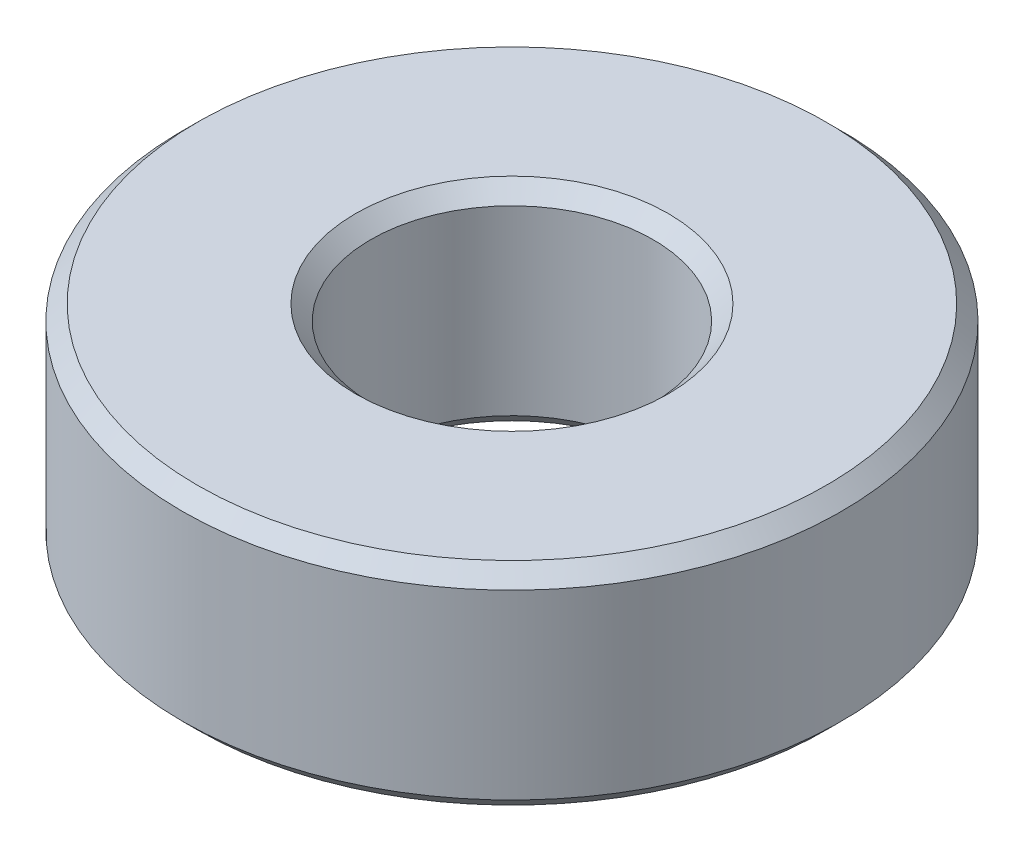
ISO-10303-21;
HEADER;
FILE_DESCRIPTION(('STEP AP214'),'2;1');
FILE_NAME('part.step','',(''),(''),'','','');
FILE_SCHEMA(('AUTOMOTIVE_DESIGN { 1 0 10303 214 1 1 1 1 }'));
ENDSEC;
DATA;
#1=APPLICATION_CONTEXT('core data for automotive mechanical design processes');
#2=APPLICATION_PROTOCOL_DEFINITION('international standard','automotive_design',2000,#1);
#3=PRODUCT_CONTEXT('',#1,'mechanical');
#4=PRODUCT('Part','Part','',(#3));
#5=PRODUCT_RELATED_PRODUCT_CATEGORY('part','',(#4));
#6=PRODUCT_DEFINITION_FORMATION('','',#4);
#7=PRODUCT_DEFINITION_CONTEXT('part definition',#1,'design');
#8=PRODUCT_DEFINITION('design','',#6,#7);
#9=PRODUCT_DEFINITION_SHAPE('','',#8);
#10=(LENGTH_UNIT() NAMED_UNIT(*) SI_UNIT(.MILLI.,.METRE.));
#11=(NAMED_UNIT(*) PLANE_ANGLE_UNIT() SI_UNIT($,.RADIAN.));
#12=(NAMED_UNIT(*) SI_UNIT($,.STERADIAN.) SOLID_ANGLE_UNIT());
#13=UNCERTAINTY_MEASURE_WITH_UNIT(LENGTH_MEASURE(1.E-05),#10,'distance_accuracy_value','');
#14=(GEOMETRIC_REPRESENTATION_CONTEXT(3) GLOBAL_UNCERTAINTY_ASSIGNED_CONTEXT((#13)) GLOBAL_UNIT_ASSIGNED_CONTEXT((#10,
#11,#12)) REPRESENTATION_CONTEXT('',''));
#15=CARTESIAN_POINT('',(0.,0.,0.));
#16=DIRECTION('',(0.,0.,1.));
#17=DIRECTION('',(1.,0.,0.));
#18=AXIS2_PLACEMENT_3D('',#15,#16,#17);
#19=CARTESIAN_POINT('',(0.,3.571875,0.));
#20=DIRECTION('',(0.,1.,0.));
#21=DIRECTION('',(0.,0.,1.));
#22=AXIS2_PLACEMENT_3D('',#19,#20,#21);
#23=PLANE('',#22);
#24=CARTESIAN_POINT('',(0.,3.571875,0.));
#25=DIRECTION('',(0.,1.,0.));
#26=DIRECTION('',(0.,0.,1.));
#27=AXIS2_PLACEMENT_3D('',#24,#25,#26);
#28=CIRCLE('',#27,5.2705);
#29=CARTESIAN_POINT('',(0.,3.571875,5.2705));
#30=VERTEX_POINT('',#29);
#31=EDGE_CURVE('E10',#30,#30,#28,.F.);
#32=ORIENTED_EDGE('',*,*,#31,.T.);
#33=EDGE_LOOP('',(#32));
#34=FACE_BOUND('',#33,.T.);
#35=CARTESIAN_POINT('',(0.,3.571875,0.));
#36=DIRECTION('',(0.,1.,0.));
#37=DIRECTION('',(0.,0.,1.));
#38=AXIS2_PLACEMENT_3D('',#35,#36,#37);
#39=CIRCLE('',#38,10.6045);
#40=CARTESIAN_POINT('',(0.,3.571875,10.6045));
#41=VERTEX_POINT('',#40);
#42=EDGE_CURVE('E21',#41,#41,#39,.T.);
#43=ORIENTED_EDGE('',*,*,#42,.T.);
#44=EDGE_LOOP('',(#43));
#45=FACE_BOUND('',#44,.T.);
#46=ADVANCED_FACE('F14',(#34,#45),#23,.T.);
#47=CARTESIAN_POINT('',(0.,-3.571875,0.));
#48=DIRECTION('',(0.,1.,0.));
#49=DIRECTION('',(0.,0.,1.));
#50=AXIS2_PLACEMENT_3D('',#47,#48,#49);
#51=PLANE('',#50);
#52=CARTESIAN_POINT('',(0.,-3.571875,0.));
#53=DIRECTION('',(0.,1.,0.));
#54=DIRECTION('',(0.,0.,1.));
#55=AXIS2_PLACEMENT_3D('',#52,#53,#54);
#56=CIRCLE('',#55,5.2705);
#57=CARTESIAN_POINT('',(0.,-3.571875,5.2705));
#58=VERTEX_POINT('',#57);
#59=EDGE_CURVE('E40',#58,#58,#56,.T.);
#60=ORIENTED_EDGE('',*,*,#59,.T.);
#61=EDGE_LOOP('',(#60));
#62=FACE_BOUND('',#61,.T.);
#63=CARTESIAN_POINT('',(0.,-3.571875,0.));
#64=DIRECTION('',(0.,1.,0.));
#65=DIRECTION('',(0.,0.,1.));
#66=AXIS2_PLACEMENT_3D('',#63,#64,#65);
#67=CIRCLE('',#66,10.6045);
#68=CARTESIAN_POINT('',(0.,-3.571875,10.6045));
#69=VERTEX_POINT('',#68);
#70=EDGE_CURVE('E43',#69,#69,#67,.F.);
#71=ORIENTED_EDGE('',*,*,#70,.T.);
#72=EDGE_LOOP('',(#71));
#73=FACE_BOUND('',#72,.T.);
#74=ADVANCED_FACE('F47',(#62,#73),#51,.F.);
#75=CARTESIAN_POINT('',(0.,3.571875,0.));
#76=DIRECTION('',(0.,-1.,0.));
#77=DIRECTION('',(0.,0.,-1.));
#78=AXIS2_PLACEMENT_3D('',#75,#76,#77);
#79=CYLINDRICAL_SURFACE('',#78,11.1125);
#80=CARTESIAN_POINT('',(0.,-3.063875,0.));
#81=DIRECTION('',(0.,1.,0.));
#82=DIRECTION('',(0.,0.,1.));
#83=AXIS2_PLACEMENT_3D('',#80,#81,#82);
#84=CIRCLE('',#83,11.1125);
#85=CARTESIAN_POINT('',(0.,-3.063875,11.1125));
#86=VERTEX_POINT('',#85);
#87=EDGE_CURVE('E25',#86,#86,#84,.T.);
#88=ORIENTED_EDGE('',*,*,#87,.T.);
#89=EDGE_LOOP('',(#88));
#90=FACE_BOUND('',#89,.T.);
#91=CARTESIAN_POINT('',(0.,3.063875,0.));
#92=DIRECTION('',(0.,1.,0.));
#93=DIRECTION('',(0.,0.,1.));
#94=AXIS2_PLACEMENT_3D('',#91,#92,#93);
#95=CIRCLE('',#94,11.1125);
#96=CARTESIAN_POINT('',(0.,3.063875,11.1125));
#97=VERTEX_POINT('',#96);
#98=EDGE_CURVE('E29',#97,#97,#95,.F.);
#99=ORIENTED_EDGE('',*,*,#98,.T.);
#100=EDGE_LOOP('',(#99));
#101=FACE_BOUND('',#100,.T.);
#102=ADVANCED_FACE('F57',(#90,#101),#79,.T.);
#103=CARTESIAN_POINT('',(0.,3.571875,0.));
#104=DIRECTION('',(0.,-1.,0.));
#105=DIRECTION('',(0.,0.,-1.));
#106=AXIS2_PLACEMENT_3D('',#103,#104,#105);
#107=CYLINDRICAL_SURFACE('',#106,4.7625);
#108=CARTESIAN_POINT('',(0.,-3.063875,0.));
#109=DIRECTION('',(0.,1.,0.));
#110=DIRECTION('',(0.,0.,1.));
#111=AXIS2_PLACEMENT_3D('',#108,#109,#110);
#112=CIRCLE('',#111,4.7625);
#113=CARTESIAN_POINT('',(0.,-3.063875,4.7625));
#114=VERTEX_POINT('',#113);
#115=EDGE_CURVE('E34',#114,#114,#112,.F.);
#116=ORIENTED_EDGE('',*,*,#115,.T.);
#117=EDGE_LOOP('',(#116));
#118=FACE_BOUND('',#117,.T.);
#119=CARTESIAN_POINT('',(0.,3.063875,0.));
#120=DIRECTION('',(0.,1.,0.));
#121=DIRECTION('',(0.,0.,1.));
#122=AXIS2_PLACEMENT_3D('',#119,#120,#121);
#123=CIRCLE('',#122,4.7625);
#124=CARTESIAN_POINT('',(0.,3.063875,4.7625));
#125=VERTEX_POINT('',#124);
#126=EDGE_CURVE('E37',#125,#125,#123,.T.);
#127=ORIENTED_EDGE('',*,*,#126,.T.);
#128=EDGE_LOOP('',(#127));
#129=FACE_BOUND('',#128,.T.);
#130=ADVANCED_FACE('F60',(#118,#129),#107,.F.);
#131=CARTESIAN_POINT('',(0.,-3.571875,0.));
#132=DIRECTION('',(0.,-1.,0.));
#133=DIRECTION('',(0.,0.,-1.));
#134=AXIS2_PLACEMENT_3D('',#131,#132,#133);
#135=CONICAL_SURFACE('',#134,5.2705,0.785398163397442);
#136=ORIENTED_EDGE('',*,*,#115,.F.);
#137=EDGE_LOOP('',(#136));
#138=FACE_BOUND('',#137,.T.);
#139=ORIENTED_EDGE('',*,*,#59,.F.);
#140=EDGE_LOOP('',(#139));
#141=FACE_BOUND('',#140,.T.);
#142=ADVANCED_FACE('F53',(#138,#141),#135,.F.);
#143=CARTESIAN_POINT('',(0.,-3.063875,0.));
#144=DIRECTION('',(0.,1.,0.));
#145=DIRECTION('',(0.,0.,1.));
#146=AXIS2_PLACEMENT_3D('',#143,#144,#145);
#147=CONICAL_SURFACE('',#146,11.1125,0.785398163397452);
#148=ORIENTED_EDGE('',*,*,#70,.F.);
#149=EDGE_LOOP('',(#148));
#150=FACE_BOUND('',#149,.T.);
#151=ORIENTED_EDGE('',*,*,#87,.F.);
#152=EDGE_LOOP('',(#151));
#153=FACE_BOUND('',#152,.T.);
#154=ADVANCED_FACE('F49',(#150,#153),#147,.T.);
#155=CARTESIAN_POINT('',(0.,3.063875,0.));
#156=DIRECTION('',(0.,1.,0.));
#157=DIRECTION('',(0.,0.,1.));
#158=AXIS2_PLACEMENT_3D('',#155,#156,#157);
#159=CONICAL_SURFACE('',#158,4.7625,0.785398163397452);
#160=ORIENTED_EDGE('',*,*,#31,.F.);
#161=EDGE_LOOP('',(#160));
#162=FACE_BOUND('',#161,.T.);
#163=ORIENTED_EDGE('',*,*,#126,.F.);
#164=EDGE_LOOP('',(#163));
#165=FACE_BOUND('',#164,.T.);
#166=ADVANCED_FACE('F52',(#162,#165),#159,.F.);
#167=CARTESIAN_POINT('',(0.,3.571875,0.));
#168=DIRECTION('',(0.,-1.,0.));
#169=DIRECTION('',(0.,0.,-1.));
#170=AXIS2_PLACEMENT_3D('',#167,#168,#169);
#171=CONICAL_SURFACE('',#170,10.6045,0.785398163397448);
#172=ORIENTED_EDGE('',*,*,#98,.F.);
#173=EDGE_LOOP('',(#172));
#174=FACE_BOUND('',#173,.T.);
#175=ORIENTED_EDGE('',*,*,#42,.F.);
#176=EDGE_LOOP('',(#175));
#177=FACE_BOUND('',#176,.T.);
#178=ADVANCED_FACE('F16',(#174,#177),#171,.T.);
#179=CLOSED_SHELL('',(#46,#74,#102,#130,#142,#154,#166,#178));
#180=MANIFOLD_SOLID_BREP('B1',#179);
#181=ADVANCED_BREP_SHAPE_REPRESENTATION('',(#18,#180),#14);
#182=SHAPE_DEFINITION_REPRESENTATION(#9,#181);
ENDSEC;
END-ISO-10303-21;
